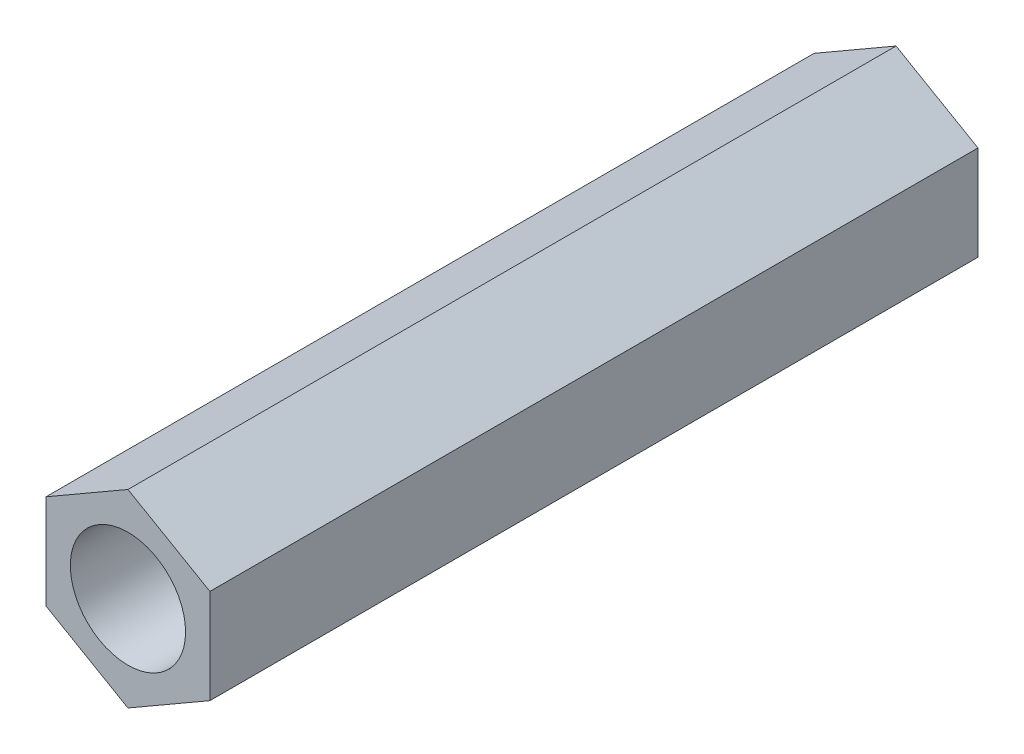
ISO-10303-21;
HEADER;
FILE_DESCRIPTION(('STEP AP214'),'2;1');
FILE_NAME('part.step','',(''),(''),'','','');
FILE_SCHEMA(('AUTOMOTIVE_DESIGN { 1 0 10303 214 1 1 1 1 }'));
ENDSEC;
DATA;
#1=APPLICATION_CONTEXT('core data for automotive mechanical design processes');
#2=APPLICATION_PROTOCOL_DEFINITION('international standard','automotive_design',2000,#1);
#3=PRODUCT_CONTEXT('',#1,'mechanical');
#4=PRODUCT('Part','Part','',(#3));
#5=PRODUCT_RELATED_PRODUCT_CATEGORY('part','',(#4));
#6=PRODUCT_DEFINITION_FORMATION('','',#4);
#7=PRODUCT_DEFINITION_CONTEXT('part definition',#1,'design');
#8=PRODUCT_DEFINITION('design','',#6,#7);
#9=PRODUCT_DEFINITION_SHAPE('','',#8);
#10=(LENGTH_UNIT() NAMED_UNIT(*) SI_UNIT(.MILLI.,.METRE.));
#11=(NAMED_UNIT(*) PLANE_ANGLE_UNIT() SI_UNIT($,.RADIAN.));
#12=(NAMED_UNIT(*) SI_UNIT($,.STERADIAN.) SOLID_ANGLE_UNIT());
#13=UNCERTAINTY_MEASURE_WITH_UNIT(LENGTH_MEASURE(1.E-05),#10,'distance_accuracy_value','');
#14=(GEOMETRIC_REPRESENTATION_CONTEXT(3) GLOBAL_UNCERTAINTY_ASSIGNED_CONTEXT((#13)) GLOBAL_UNIT_ASSIGNED_CONTEXT((#10,
#11,#12)) REPRESENTATION_CONTEXT('',''));
#15=CARTESIAN_POINT('',(0.,0.,0.));
#16=DIRECTION('',(0.,0.,1.));
#17=DIRECTION('',(1.,0.,0.));
#18=AXIS2_PLACEMENT_3D('',#15,#16,#17);
#19=CARTESIAN_POINT('',(0.,0.,20.));
#20=DIRECTION('',(0.,0.,1.));
#21=DIRECTION('',(1.,0.,0.));
#22=AXIS2_PLACEMENT_3D('',#19,#20,#21);
#23=PLANE('',#22);
#24=DIRECTION('',(-0.866025403784442,0.499999999999995,0.));
#25=VECTOR('',#24,1.);
#26=CARTESIAN_POINT('',(2.13382530169226,1.23196461233569,20.));
#27=LINE('',#26,#25);
#28=CARTESIAN_POINT('',(2.13382530169226,1.23196461233569,20.));
#29=VERTEX_POINT('',#28);
#30=CARTESIAN_POINT('',(0.,2.46392922467133,20.));
#31=VERTEX_POINT('',#30);
#32=EDGE_CURVE('E133',#29,#31,#27,.T.);
#33=ORIENTED_EDGE('',*,*,#32,.T.);
#34=DIRECTION('',(-0.866025403784438,-0.500000000000001,0.));
#35=VECTOR('',#34,1.);
#36=CARTESIAN_POINT('',(0.,2.46392922467133,20.));
#37=LINE('',#36,#35);
#38=CARTESIAN_POINT('',(-2.13382530169227,1.23196461233566,20.));
#39=VERTEX_POINT('',#38);
#40=EDGE_CURVE('E91',#31,#39,#37,.T.);
#41=ORIENTED_EDGE('',*,*,#40,.T.);
#42=DIRECTION('',(0.,-1.,0.));
#43=VECTOR('',#42,1.);
#44=CARTESIAN_POINT('',(-2.13382530169227,1.23196461233566,20.));
#45=LINE('',#44,#43);
#46=CARTESIAN_POINT('',(-2.13382530169226,-1.23196461233568,20.));
#47=VERTEX_POINT('',#46);
#48=EDGE_CURVE('E104',#39,#47,#45,.T.);
#49=ORIENTED_EDGE('',*,*,#48,.T.);
#50=DIRECTION('',(0.866025403784442,-0.499999999999995,0.));
#51=VECTOR('',#50,1.);
#52=CARTESIAN_POINT('',(-2.13382530169226,-1.23196461233568,20.));
#53=LINE('',#52,#51);
#54=CARTESIAN_POINT('',(0.,-2.46392922467133,20.));
#55=VERTEX_POINT('',#54);
#56=EDGE_CURVE('E98',#47,#55,#53,.T.);
#57=ORIENTED_EDGE('',*,*,#56,.T.);
#58=DIRECTION('',(0.866025403784434,0.500000000000007,0.));
#59=VECTOR('',#58,1.);
#60=CARTESIAN_POINT('',(0.,-2.46392922467133,20.));
#61=LINE('',#60,#59);
#62=CARTESIAN_POINT('',(2.13382530169228,-1.23196461233565,20.));
#63=VERTEX_POINT('',#62);
#64=EDGE_CURVE('E102',#55,#63,#61,.T.);
#65=ORIENTED_EDGE('',*,*,#64,.T.);
#66=DIRECTION('',(0.,1.,0.));
#67=VECTOR('',#66,1.);
#68=CARTESIAN_POINT('',(2.13382530169228,-1.23196461233565,20.));
#69=LINE('',#68,#67);
#70=EDGE_CURVE('E54',#63,#29,#69,.T.);
#71=ORIENTED_EDGE('',*,*,#70,.T.);
#72=EDGE_LOOP('',(#33,#41,#49,#57,#65,#71));
#73=FACE_BOUND('',#72,.T.);
#74=CARTESIAN_POINT('',(0.,0.,20.));
#75=DIRECTION('',(0.,0.,1.));
#76=DIRECTION('',(1.,0.,0.));
#77=AXIS2_PLACEMENT_3D('',#74,#75,#76);
#78=CIRCLE('',#77,1.5);
#79=CARTESIAN_POINT('',(1.5,0.,20.));
#80=VERTEX_POINT('',#79);
#81=EDGE_CURVE('E126',#80,#80,#78,.T.);
#82=ORIENTED_EDGE('',*,*,#81,.F.);
#83=EDGE_LOOP('',(#82));
#84=FACE_BOUND('',#83,.T.);
#85=ADVANCED_FACE('F37',(#73,#84),#23,.T.);
#86=CARTESIAN_POINT('',(0.,0.,0.));
#87=DIRECTION('',(0.,0.,1.));
#88=DIRECTION('',(1.,0.,0.));
#89=AXIS2_PLACEMENT_3D('',#86,#87,#88);
#90=PLANE('',#89);
#91=DIRECTION('',(-0.866025403784442,0.499999999999995,0.));
#92=VECTOR('',#91,1.);
#93=CARTESIAN_POINT('',(2.13382530169226,1.23196461233569,0.));
#94=LINE('',#93,#92);
#95=CARTESIAN_POINT('',(2.13382530169226,1.23196461233569,0.));
#96=VERTEX_POINT('',#95);
#97=CARTESIAN_POINT('',(0.,2.46392922467133,0.));
#98=VERTEX_POINT('',#97);
#99=EDGE_CURVE('E122',#96,#98,#94,.T.);
#100=ORIENTED_EDGE('',*,*,#99,.F.);
#101=DIRECTION('',(0.,1.,0.));
#102=VECTOR('',#101,1.);
#103=CARTESIAN_POINT('',(2.13382530169228,-1.23196461233565,0.));
#104=LINE('',#103,#102);
#105=CARTESIAN_POINT('',(2.13382530169228,-1.23196461233565,0.));
#106=VERTEX_POINT('',#105);
#107=EDGE_CURVE('E83',#106,#96,#104,.T.);
#108=ORIENTED_EDGE('',*,*,#107,.F.);
#109=DIRECTION('',(0.866025403784434,0.500000000000007,0.));
#110=VECTOR('',#109,1.);
#111=CARTESIAN_POINT('',(0.,-2.46392922467133,0.));
#112=LINE('',#111,#110);
#113=CARTESIAN_POINT('',(0.,-2.46392922467133,0.));
#114=VERTEX_POINT('',#113);
#115=EDGE_CURVE('E77',#114,#106,#112,.T.);
#116=ORIENTED_EDGE('',*,*,#115,.F.);
#117=DIRECTION('',(0.866025403784442,-0.499999999999995,0.));
#118=VECTOR('',#117,1.);
#119=CARTESIAN_POINT('',(-2.13382530169226,-1.23196461233568,0.));
#120=LINE('',#119,#118);
#121=CARTESIAN_POINT('',(-2.13382530169226,-1.23196461233568,0.));
#122=VERTEX_POINT('',#121);
#123=EDGE_CURVE('E112',#122,#114,#120,.T.);
#124=ORIENTED_EDGE('',*,*,#123,.F.);
#125=DIRECTION('',(0.,-1.,0.));
#126=VECTOR('',#125,1.);
#127=CARTESIAN_POINT('',(-2.13382530169227,1.23196461233566,0.));
#128=LINE('',#127,#126);
#129=CARTESIAN_POINT('',(-2.13382530169227,1.23196461233566,0.));
#130=VERTEX_POINT('',#129);
#131=EDGE_CURVE('E128',#130,#122,#128,.T.);
#132=ORIENTED_EDGE('',*,*,#131,.F.);
#133=DIRECTION('',(-0.866025403784438,-0.500000000000001,0.));
#134=VECTOR('',#133,1.);
#135=CARTESIAN_POINT('',(0.,2.46392922467133,0.));
#136=LINE('',#135,#134);
#137=EDGE_CURVE('E125',#98,#130,#136,.T.);
#138=ORIENTED_EDGE('',*,*,#137,.F.);
#139=EDGE_LOOP('',(#100,#108,#116,#124,#132,#138));
#140=FACE_BOUND('',#139,.T.);
#141=CARTESIAN_POINT('',(0.,0.,0.));
#142=DIRECTION('',(0.,0.,1.));
#143=DIRECTION('',(1.,0.,0.));
#144=AXIS2_PLACEMENT_3D('',#141,#142,#143);
#145=CIRCLE('',#144,1.5);
#146=CARTESIAN_POINT('',(1.5,0.,0.));
#147=VERTEX_POINT('',#146);
#148=EDGE_CURVE('E226',#147,#147,#145,.T.);
#149=ORIENTED_EDGE('',*,*,#148,.T.);
#150=EDGE_LOOP('',(#149));
#151=FACE_BOUND('',#150,.T.);
#152=ADVANCED_FACE('F142',(#140,#151),#90,.F.);
#153=CARTESIAN_POINT('',(2.13382530169226,1.23196461233569,20.));
#154=DIRECTION('',(-0.499999999999995,-0.866025403784442,0.));
#155=DIRECTION('',(0.866025403784442,-0.499999999999995,0.));
#156=AXIS2_PLACEMENT_3D('',#153,#154,#155);
#157=PLANE('',#156);
#158=ORIENTED_EDGE('',*,*,#99,.T.);
#159=DIRECTION('',(0.,0.,-1.));
#160=VECTOR('',#159,1.);
#161=CARTESIAN_POINT('',(0.,2.46392922467133,20.));
#162=LINE('',#161,#160);
#163=EDGE_CURVE('E11',#31,#98,#162,.T.);
#164=ORIENTED_EDGE('',*,*,#163,.F.);
#165=ORIENTED_EDGE('',*,*,#32,.F.);
#166=DIRECTION('',(0.,0.,-1.));
#167=VECTOR('',#166,1.);
#168=CARTESIAN_POINT('',(2.13382530169226,1.23196461233569,20.));
#169=LINE('',#168,#167);
#170=EDGE_CURVE('E118',#29,#96,#169,.T.);
#171=ORIENTED_EDGE('',*,*,#170,.T.);
#172=EDGE_LOOP('',(#158,#164,#165,#171));
#173=FACE_BOUND('',#172,.T.);
#174=ADVANCED_FACE('F39',(#173),#157,.F.);
#175=CARTESIAN_POINT('',(0.,2.46392922467133,20.));
#176=DIRECTION('',(0.500000000000001,-0.866025403784438,0.));
#177=DIRECTION('',(0.866025403784438,0.500000000000001,0.));
#178=AXIS2_PLACEMENT_3D('',#175,#176,#177);
#179=PLANE('',#178);
#180=ORIENTED_EDGE('',*,*,#137,.T.);
#181=DIRECTION('',(0.,0.,-1.));
#182=VECTOR('',#181,1.);
#183=CARTESIAN_POINT('',(-2.13382530169227,1.23196461233566,20.));
#184=LINE('',#183,#182);
#185=EDGE_CURVE('E46',#39,#130,#184,.T.);
#186=ORIENTED_EDGE('',*,*,#185,.F.);
#187=ORIENTED_EDGE('',*,*,#40,.F.);
#188=ORIENTED_EDGE('',*,*,#163,.T.);
#189=EDGE_LOOP('',(#180,#186,#187,#188));
#190=FACE_BOUND('',#189,.T.);
#191=ADVANCED_FACE('F167',(#190),#179,.F.);
#192=CARTESIAN_POINT('',(-2.13382530169227,1.23196461233566,20.));
#193=DIRECTION('',(1.,0.,0.));
#194=DIRECTION('',(0.,1.,0.));
#195=AXIS2_PLACEMENT_3D('',#192,#193,#194);
#196=PLANE('',#195);
#197=ORIENTED_EDGE('',*,*,#131,.T.);
#198=DIRECTION('',(0.,0.,-1.));
#199=VECTOR('',#198,1.);
#200=CARTESIAN_POINT('',(-2.13382530169226,-1.23196461233568,20.));
#201=LINE('',#200,#199);
#202=EDGE_CURVE('E113',#47,#122,#201,.T.);
#203=ORIENTED_EDGE('',*,*,#202,.F.);
#204=ORIENTED_EDGE('',*,*,#48,.F.);
#205=ORIENTED_EDGE('',*,*,#185,.T.);
#206=EDGE_LOOP('',(#197,#203,#204,#205));
#207=FACE_BOUND('',#206,.T.);
#208=ADVANCED_FACE('F139',(#207),#196,.F.);
#209=CARTESIAN_POINT('',(-2.13382530169226,-1.23196461233568,20.));
#210=DIRECTION('',(0.499999999999995,0.866025403784442,0.));
#211=DIRECTION('',(-0.866025403784442,0.499999999999995,0.));
#212=AXIS2_PLACEMENT_3D('',#209,#210,#211);
#213=PLANE('',#212);
#214=ORIENTED_EDGE('',*,*,#123,.T.);
#215=DIRECTION('',(0.,0.,-1.));
#216=VECTOR('',#215,1.);
#217=CARTESIAN_POINT('',(0.,-2.46392922467133,20.));
#218=LINE('',#217,#216);
#219=EDGE_CURVE('E109',#55,#114,#218,.T.);
#220=ORIENTED_EDGE('',*,*,#219,.F.);
#221=ORIENTED_EDGE('',*,*,#56,.F.);
#222=ORIENTED_EDGE('',*,*,#202,.T.);
#223=EDGE_LOOP('',(#214,#220,#221,#222));
#224=FACE_BOUND('',#223,.T.);
#225=ADVANCED_FACE('F110',(#224),#213,.F.);
#226=CARTESIAN_POINT('',(0.,-2.46392922467133,20.));
#227=DIRECTION('',(-0.500000000000007,0.866025403784435,0.));
#228=DIRECTION('',(-0.866025403784435,-0.500000000000007,0.));
#229=AXIS2_PLACEMENT_3D('',#226,#227,#228);
#230=PLANE('',#229);
#231=ORIENTED_EDGE('',*,*,#115,.T.);
#232=DIRECTION('',(0.,0.,-1.));
#233=VECTOR('',#232,1.);
#234=CARTESIAN_POINT('',(2.13382530169228,-1.23196461233565,20.));
#235=LINE('',#234,#233);
#236=EDGE_CURVE('E114',#63,#106,#235,.T.);
#237=ORIENTED_EDGE('',*,*,#236,.F.);
#238=ORIENTED_EDGE('',*,*,#64,.F.);
#239=ORIENTED_EDGE('',*,*,#219,.T.);
#240=EDGE_LOOP('',(#231,#237,#238,#239));
#241=FACE_BOUND('',#240,.T.);
#242=ADVANCED_FACE('F116',(#241),#230,.F.);
#243=CARTESIAN_POINT('',(2.13382530169228,-1.23196461233565,20.));
#244=DIRECTION('',(-1.,0.,0.));
#245=DIRECTION('',(0.,-1.,0.));
#246=AXIS2_PLACEMENT_3D('',#243,#244,#245);
#247=PLANE('',#246);
#248=ORIENTED_EDGE('',*,*,#107,.T.);
#249=ORIENTED_EDGE('',*,*,#170,.F.);
#250=ORIENTED_EDGE('',*,*,#70,.F.);
#251=ORIENTED_EDGE('',*,*,#236,.T.);
#252=EDGE_LOOP('',(#248,#249,#250,#251));
#253=FACE_BOUND('',#252,.T.);
#254=ADVANCED_FACE('F147',(#253),#247,.F.);
#255=CARTESIAN_POINT('',(0.,0.,20.));
#256=DIRECTION('',(0.,0.,-1.));
#257=DIRECTION('',(-1.,0.,0.));
#258=AXIS2_PLACEMENT_3D('',#255,#256,#257);
#259=CYLINDRICAL_SURFACE('',#258,1.5);
#260=ORIENTED_EDGE('',*,*,#81,.T.);
#261=EDGE_LOOP('',(#260));
#262=FACE_BOUND('',#261,.T.);
#263=ORIENTED_EDGE('',*,*,#148,.F.);
#264=EDGE_LOOP('',(#263));
#265=FACE_BOUND('',#264,.T.);
#266=ADVANCED_FACE('F149',(#262,#265),#259,.F.);
#267=CLOSED_SHELL('',(#85,#152,#174,#191,#208,#225,#242,#254,#266));
#268=MANIFOLD_SOLID_BREP('B2',#267);
#269=ADVANCED_BREP_SHAPE_REPRESENTATION('',(#18,#268),#14);
#270=SHAPE_DEFINITION_REPRESENTATION(#9,#269);
ENDSEC;
END-ISO-10303-21;
